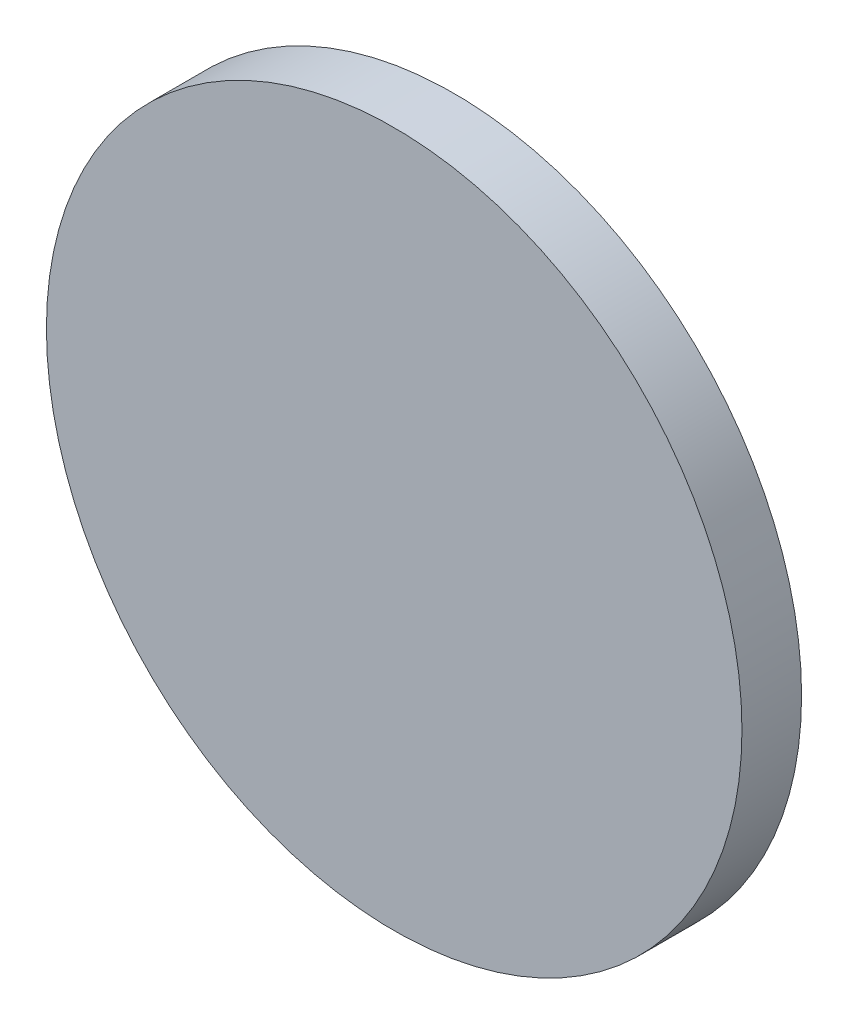
ISO-10303-21;
HEADER;
FILE_DESCRIPTION(('STEP AP214'),'2;1');
FILE_NAME('part.step','',(''),(''),'','','');
FILE_SCHEMA(('AUTOMOTIVE_DESIGN { 1 0 10303 214 1 1 1 1 }'));
ENDSEC;
DATA;
#1=APPLICATION_CONTEXT('core data for automotive mechanical design processes');
#2=APPLICATION_PROTOCOL_DEFINITION('international standard','automotive_design',2000,#1);
#3=PRODUCT_CONTEXT('',#1,'mechanical');
#4=PRODUCT('Part','Part','',(#3));
#5=PRODUCT_RELATED_PRODUCT_CATEGORY('part','',(#4));
#6=PRODUCT_DEFINITION_FORMATION('','',#4);
#7=PRODUCT_DEFINITION_CONTEXT('part definition',#1,'design');
#8=PRODUCT_DEFINITION('design','',#6,#7);
#9=PRODUCT_DEFINITION_SHAPE('','',#8);
#10=(LENGTH_UNIT() NAMED_UNIT(*) SI_UNIT(.MILLI.,.METRE.));
#11=(NAMED_UNIT(*) PLANE_ANGLE_UNIT() SI_UNIT($,.RADIAN.));
#12=(NAMED_UNIT(*) SI_UNIT($,.STERADIAN.) SOLID_ANGLE_UNIT());
#13=UNCERTAINTY_MEASURE_WITH_UNIT(LENGTH_MEASURE(1.E-05),#10,'distance_accuracy_value','');
#14=(GEOMETRIC_REPRESENTATION_CONTEXT(3) GLOBAL_UNCERTAINTY_ASSIGNED_CONTEXT((#13)) GLOBAL_UNIT_ASSIGNED_CONTEXT((#10,
#11,#12)) REPRESENTATION_CONTEXT('',''));
#15=CARTESIAN_POINT('',(0.,0.,0.));
#16=DIRECTION('',(0.,0.,1.));
#17=DIRECTION('',(1.,0.,0.));
#18=AXIS2_PLACEMENT_3D('',#15,#16,#17);
#19=CARTESIAN_POINT('',(9.73836,1.577340014875,0.));
#20=DIRECTION('',(0.,0.,-1.));
#21=DIRECTION('',(-1.,0.,0.));
#22=AXIS2_PLACEMENT_3D('',#19,#20,#21);
#23=PLANE('',#22);
#24=CARTESIAN_POINT('',(9.73836,1.577340014875,0.));
#25=DIRECTION('',(0.,0.,1.));
#26=DIRECTION('',(1.,0.,0.));
#27=AXIS2_PLACEMENT_3D('',#24,#25,#26);
#28=CIRCLE('',#27,0.200024667);
#29=CARTESIAN_POINT('',(9.938384667,1.577340014875,0.));
#30=VERTEX_POINT('',#29);
#31=EDGE_CURVE('E18',#30,#30,#28,.T.);
#32=ORIENTED_EDGE('',*,*,#31,.F.);
#33=EDGE_LOOP('',(#32));
#34=FACE_BOUND('',#33,.T.);
#35=ADVANCED_FACE('F15',(#34),#23,.T.);
#36=CARTESIAN_POINT('',(9.73836,1.577340014875,0.));
#37=DIRECTION('',(0.,0.,1.));
#38=DIRECTION('',(1.,0.,0.));
#39=AXIS2_PLACEMENT_3D('',#36,#37,#38);
#40=CYLINDRICAL_SURFACE('',#39,0.200024667);
#41=CARTESIAN_POINT('',(9.73836,1.577340014875,0.03429));
#42=DIRECTION('',(0.,0.,1.));
#43=DIRECTION('',(1.,0.,0.));
#44=AXIS2_PLACEMENT_3D('',#41,#42,#43);
#45=CIRCLE('',#44,0.200024667);
#46=CARTESIAN_POINT('',(9.938384667,1.577340014875,0.03429));
#47=VERTEX_POINT('',#46);
#48=EDGE_CURVE('E10',#47,#47,#45,.T.);
#49=ORIENTED_EDGE('',*,*,#48,.F.);
#50=EDGE_LOOP('',(#49));
#51=FACE_BOUND('',#50,.T.);
#52=ORIENTED_EDGE('',*,*,#31,.T.);
#53=EDGE_LOOP('',(#52));
#54=FACE_BOUND('',#53,.T.);
#55=ADVANCED_FACE('F27',(#51,#54),#40,.T.);
#56=CARTESIAN_POINT('',(9.73836,1.577340014875,0.03429));
#57=DIRECTION('',(0.,0.,1.));
#58=DIRECTION('',(1.,0.,0.));
#59=AXIS2_PLACEMENT_3D('',#56,#57,#58);
#60=PLANE('',#59);
#61=ORIENTED_EDGE('',*,*,#48,.T.);
#62=EDGE_LOOP('',(#61));
#63=FACE_BOUND('',#62,.T.);
#64=ADVANCED_FACE('F34',(#63),#60,.T.);
#65=CLOSED_SHELL('',(#35,#55,#64));
#66=MANIFOLD_SOLID_BREP('B1',#65);
#67=ADVANCED_BREP_SHAPE_REPRESENTATION('',(#18,#66),#14);
#68=SHAPE_DEFINITION_REPRESENTATION(#9,#67);
ENDSEC;
END-ISO-10303-21;
